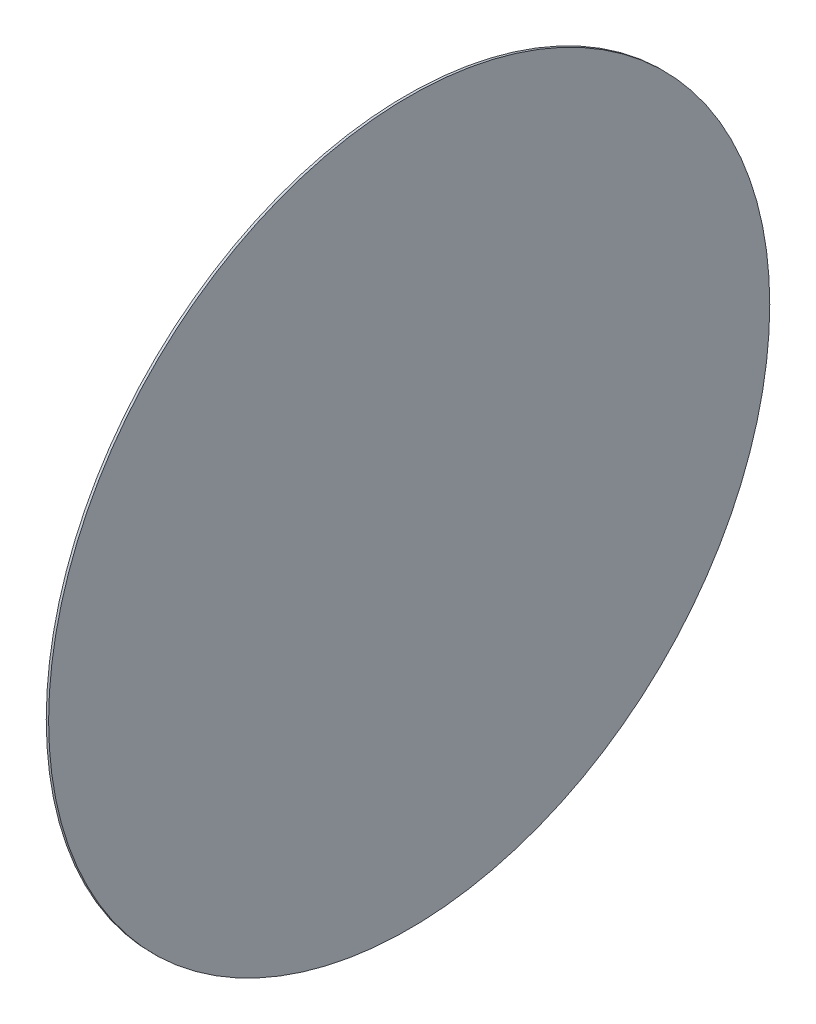
ISO-10303-21;
HEADER;
FILE_DESCRIPTION(('STEP AP214'),'2;1');
FILE_NAME('part.step','',(''),(''),'','','');
FILE_SCHEMA(('AUTOMOTIVE_DESIGN { 1 0 10303 214 1 1 1 1 }'));
ENDSEC;
DATA;
#1=APPLICATION_CONTEXT('core data for automotive mechanical design processes');
#2=APPLICATION_PROTOCOL_DEFINITION('international standard','automotive_design',2000,#1);
#3=PRODUCT_CONTEXT('',#1,'mechanical');
#4=PRODUCT('Part','Part','',(#3));
#5=PRODUCT_RELATED_PRODUCT_CATEGORY('part','',(#4));
#6=PRODUCT_DEFINITION_FORMATION('','',#4);
#7=PRODUCT_DEFINITION_CONTEXT('part definition',#1,'design');
#8=PRODUCT_DEFINITION('design','',#6,#7);
#9=PRODUCT_DEFINITION_SHAPE('','',#8);
#10=(LENGTH_UNIT() NAMED_UNIT(*) SI_UNIT(.MILLI.,.METRE.));
#11=(NAMED_UNIT(*) PLANE_ANGLE_UNIT() SI_UNIT($,.RADIAN.));
#12=(NAMED_UNIT(*) SI_UNIT($,.STERADIAN.) SOLID_ANGLE_UNIT());
#13=UNCERTAINTY_MEASURE_WITH_UNIT(LENGTH_MEASURE(1.E-05),#10,'distance_accuracy_value','');
#14=(GEOMETRIC_REPRESENTATION_CONTEXT(3) GLOBAL_UNCERTAINTY_ASSIGNED_CONTEXT((#13)) GLOBAL_UNIT_ASSIGNED_CONTEXT((#10,
#11,#12)) REPRESENTATION_CONTEXT('',''));
#15=CARTESIAN_POINT('',(0.,0.,0.));
#16=DIRECTION('',(0.,0.,1.));
#17=DIRECTION('',(1.,0.,0.));
#18=AXIS2_PLACEMENT_3D('',#15,#16,#17);
#19=CARTESIAN_POINT('',(0.,0.,0.));
#20=DIRECTION('',(-1.,0.,0.));
#21=DIRECTION('',(0.,0.,1.));
#22=AXIS2_PLACEMENT_3D('',#19,#20,#21);
#23=CYLINDRICAL_SURFACE('',#22,9.);
#24=CARTESIAN_POINT('',(0.,0.,0.));
#25=DIRECTION('',(-1.,0.,0.));
#26=DIRECTION('',(0.,0.,1.));
#27=AXIS2_PLACEMENT_3D('',#24,#25,#26);
#28=CIRCLE('',#27,9.);
#29=CARTESIAN_POINT('',(0.,0.,9.));
#30=VERTEX_POINT('',#29);
#31=EDGE_CURVE('E44',#30,#30,#28,.T.);
#32=ORIENTED_EDGE('',*,*,#31,.F.);
#33=EDGE_LOOP('',(#32));
#34=FACE_BOUND('',#33,.T.);
#35=CARTESIAN_POINT('',(0.0589999999999988,0.,0.));
#36=DIRECTION('',(-1.,0.,0.));
#37=DIRECTION('',(0.,0.,1.));
#38=AXIS2_PLACEMENT_3D('',#35,#36,#37);
#39=CIRCLE('',#38,9.);
#40=CARTESIAN_POINT('',(0.0589999999999988,0.,9.));
#41=VERTEX_POINT('',#40);
#42=EDGE_CURVE('E10',#41,#41,#39,.T.);
#43=ORIENTED_EDGE('',*,*,#42,.T.);
#44=EDGE_LOOP('',(#43));
#45=FACE_BOUND('',#44,.T.);
#46=ADVANCED_FACE('F37',(#34,#45),#23,.T.);
#47=CARTESIAN_POINT('',(0.0589999999999994,9.,0.));
#48=DIRECTION('',(-1.,0.,0.));
#49=DIRECTION('',(0.,0.,1.));
#50=AXIS2_PLACEMENT_3D('',#47,#48,#49);
#51=PLANE('',#50);
#52=ORIENTED_EDGE('',*,*,#42,.F.);
#53=EDGE_LOOP('',(#52));
#54=FACE_BOUND('',#53,.T.);
#55=ADVANCED_FACE('F54',(#54),#51,.F.);
#56=CARTESIAN_POINT('',(0.,9.,0.));
#57=DIRECTION('',(1.,0.,0.));
#58=DIRECTION('',(0.,0.,-1.));
#59=AXIS2_PLACEMENT_3D('',#56,#57,#58);
#60=PLANE('',#59);
#61=ORIENTED_EDGE('',*,*,#31,.T.);
#62=EDGE_LOOP('',(#61));
#63=FACE_BOUND('',#62,.T.);
#64=ADVANCED_FACE('F51',(#63),#60,.F.);
#65=CLOSED_SHELL('',(#46,#55,#64));
#66=MANIFOLD_SOLID_BREP('B2',#65);
#67=ADVANCED_BREP_SHAPE_REPRESENTATION('',(#18,#66),#14);
#68=SHAPE_DEFINITION_REPRESENTATION(#9,#67);
ENDSEC;
END-ISO-10303-21;
